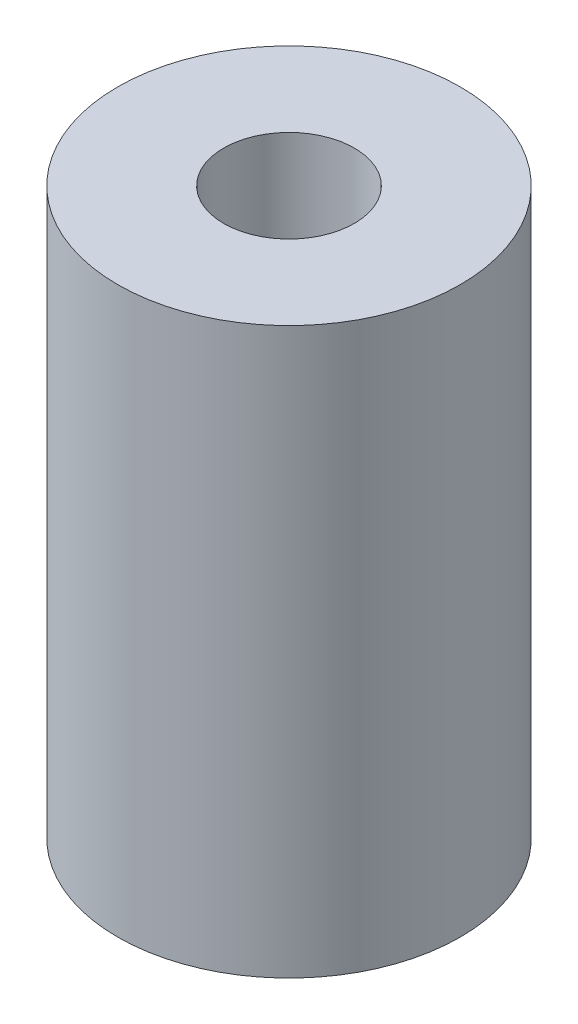
ISO-10303-21;
HEADER;
FILE_DESCRIPTION(('STEP AP214'),'2;1');
FILE_NAME('part.step','',(''),(''),'','','');
FILE_SCHEMA(('AUTOMOTIVE_DESIGN { 1 0 10303 214 1 1 1 1 }'));
ENDSEC;
DATA;
#1=APPLICATION_CONTEXT('core data for automotive mechanical design processes');
#2=APPLICATION_PROTOCOL_DEFINITION('international standard','automotive_design',2000,#1);
#3=PRODUCT_CONTEXT('',#1,'mechanical');
#4=PRODUCT('Part','Part','',(#3));
#5=PRODUCT_RELATED_PRODUCT_CATEGORY('part','',(#4));
#6=PRODUCT_DEFINITION_FORMATION('','',#4);
#7=PRODUCT_DEFINITION_CONTEXT('part definition',#1,'design');
#8=PRODUCT_DEFINITION('design','',#6,#7);
#9=PRODUCT_DEFINITION_SHAPE('','',#8);
#10=(LENGTH_UNIT() NAMED_UNIT(*) SI_UNIT(.MILLI.,.METRE.));
#11=(NAMED_UNIT(*) PLANE_ANGLE_UNIT() SI_UNIT($,.RADIAN.));
#12=(NAMED_UNIT(*) SI_UNIT($,.STERADIAN.) SOLID_ANGLE_UNIT());
#13=UNCERTAINTY_MEASURE_WITH_UNIT(LENGTH_MEASURE(1.E-05),#10,'distance_accuracy_value','');
#14=(GEOMETRIC_REPRESENTATION_CONTEXT(3) GLOBAL_UNCERTAINTY_ASSIGNED_CONTEXT((#13)) GLOBAL_UNIT_ASSIGNED_CONTEXT((#10,
#11,#12)) REPRESENTATION_CONTEXT('',''));
#15=CARTESIAN_POINT('',(0.,0.,0.));
#16=DIRECTION('',(0.,0.,1.));
#17=DIRECTION('',(1.,0.,0.));
#18=AXIS2_PLACEMENT_3D('',#15,#16,#17);
#19=CARTESIAN_POINT('',(0.,16.,0.));
#20=DIRECTION('',(0.,1.,0.));
#21=DIRECTION('',(0.,0.,1.));
#22=AXIS2_PLACEMENT_3D('',#19,#20,#21);
#23=PLANE('',#22);
#24=CARTESIAN_POINT('',(0.,16.,0.));
#25=DIRECTION('',(0.,1.,0.));
#26=DIRECTION('',(1.,0.,0.));
#27=AXIS2_PLACEMENT_3D('',#24,#25,#26);
#28=CIRCLE('',#27,4.85);
#29=CARTESIAN_POINT('',(4.85,16.,0.));
#30=VERTEX_POINT('',#29);
#31=EDGE_CURVE('E11',#30,#30,#28,.T.);
#32=ORIENTED_EDGE('',*,*,#31,.T.);
#33=EDGE_LOOP('',(#32));
#34=FACE_BOUND('',#33,.T.);
#35=CARTESIAN_POINT('',(0.,16.,0.));
#36=DIRECTION('',(0.,1.,0.));
#37=DIRECTION('',(0.,0.,1.));
#38=AXIS2_PLACEMENT_3D('',#35,#36,#37);
#39=CIRCLE('',#38,1.85);
#40=CARTESIAN_POINT('',(0.,16.,1.85));
#41=VERTEX_POINT('',#40);
#42=EDGE_CURVE('E56',#41,#41,#39,.T.);
#43=ORIENTED_EDGE('',*,*,#42,.F.);
#44=EDGE_LOOP('',(#43));
#45=FACE_BOUND('',#44,.T.);
#46=ADVANCED_FACE('F45',(#34,#45),#23,.T.);
#47=CARTESIAN_POINT('',(0.,0.,0.));
#48=DIRECTION('',(0.,1.,0.));
#49=DIRECTION('',(0.,0.,1.));
#50=AXIS2_PLACEMENT_3D('',#47,#48,#49);
#51=PLANE('',#50);
#52=CARTESIAN_POINT('',(0.,0.,0.));
#53=DIRECTION('',(0.,1.,0.));
#54=DIRECTION('',(1.,0.,0.));
#55=AXIS2_PLACEMENT_3D('',#52,#53,#54);
#56=CIRCLE('',#55,4.85);
#57=CARTESIAN_POINT('',(4.85,0.,0.));
#58=VERTEX_POINT('',#57);
#59=EDGE_CURVE('E49',#58,#58,#56,.T.);
#60=ORIENTED_EDGE('',*,*,#59,.F.);
#61=EDGE_LOOP('',(#60));
#62=FACE_BOUND('',#61,.T.);
#63=CARTESIAN_POINT('',(0.,0.,0.));
#64=DIRECTION('',(0.,1.,0.));
#65=DIRECTION('',(0.,0.,1.));
#66=AXIS2_PLACEMENT_3D('',#63,#64,#65);
#67=CIRCLE('',#66,1.85);
#68=CARTESIAN_POINT('',(0.,0.,1.85));
#69=VERTEX_POINT('',#68);
#70=EDGE_CURVE('E58',#69,#69,#67,.T.);
#71=ORIENTED_EDGE('',*,*,#70,.T.);
#72=EDGE_LOOP('',(#71));
#73=FACE_BOUND('',#72,.T.);
#74=ADVANCED_FACE('F68',(#62,#73),#51,.F.);
#75=CARTESIAN_POINT('',(0.,16.,0.));
#76=DIRECTION('',(0.,-1.,0.));
#77=DIRECTION('',(0.,0.,-1.));
#78=AXIS2_PLACEMENT_3D('',#75,#76,#77);
#79=CYLINDRICAL_SURFACE('',#78,4.85);
#80=ORIENTED_EDGE('',*,*,#31,.F.);
#81=EDGE_LOOP('',(#80));
#82=FACE_BOUND('',#81,.T.);
#83=ORIENTED_EDGE('',*,*,#59,.T.);
#84=EDGE_LOOP('',(#83));
#85=FACE_BOUND('',#84,.T.);
#86=ADVANCED_FACE('F47',(#82,#85),#79,.T.);
#87=CARTESIAN_POINT('',(0.,16.,0.));
#88=DIRECTION('',(0.,-1.,0.));
#89=DIRECTION('',(0.,0.,-1.));
#90=AXIS2_PLACEMENT_3D('',#87,#88,#89);
#91=CYLINDRICAL_SURFACE('',#90,1.85);
#92=ORIENTED_EDGE('',*,*,#42,.T.);
#93=EDGE_LOOP('',(#92));
#94=FACE_BOUND('',#93,.T.);
#95=ORIENTED_EDGE('',*,*,#70,.F.);
#96=EDGE_LOOP('',(#95));
#97=FACE_BOUND('',#96,.T.);
#98=ADVANCED_FACE('F64',(#94,#97),#91,.F.);
#99=CLOSED_SHELL('',(#46,#74,#86,#98));
#100=MANIFOLD_SOLID_BREP('B2',#99);
#101=ADVANCED_BREP_SHAPE_REPRESENTATION('',(#18,#100),#14);
#102=SHAPE_DEFINITION_REPRESENTATION(#9,#101);
ENDSEC;
END-ISO-10303-21;
